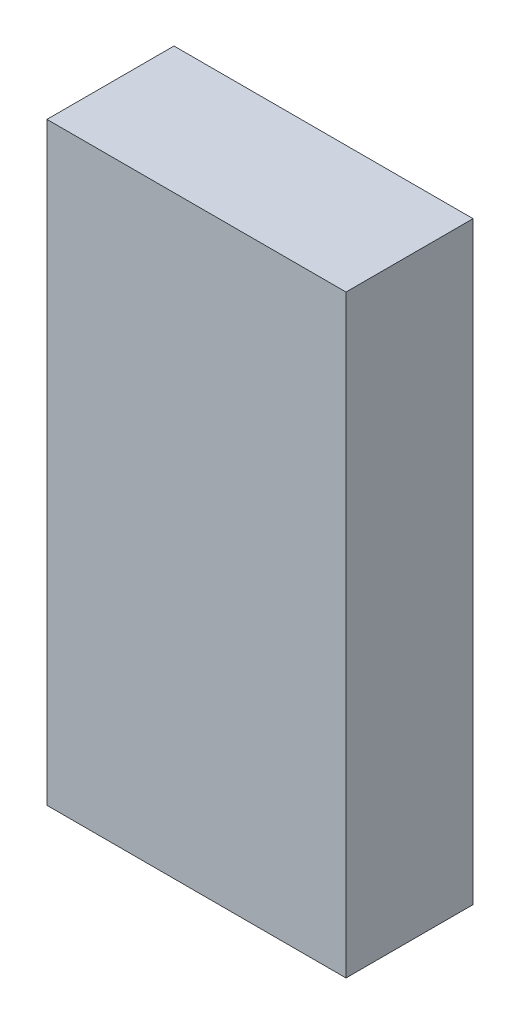
ISO-10303-21;
HEADER;
FILE_DESCRIPTION(('STEP AP214'),'2;1');
FILE_NAME('part.step','',(''),(''),'','','');
FILE_SCHEMA(('AUTOMOTIVE_DESIGN { 1 0 10303 214 1 1 1 1 }'));
ENDSEC;
DATA;
#1=APPLICATION_CONTEXT('core data for automotive mechanical design processes');
#2=APPLICATION_PROTOCOL_DEFINITION('international standard','automotive_design',2000,#1);
#3=PRODUCT_CONTEXT('',#1,'mechanical');
#4=PRODUCT('Part','Part','',(#3));
#5=PRODUCT_RELATED_PRODUCT_CATEGORY('part','',(#4));
#6=PRODUCT_DEFINITION_FORMATION('','',#4);
#7=PRODUCT_DEFINITION_CONTEXT('part definition',#1,'design');
#8=PRODUCT_DEFINITION('design','',#6,#7);
#9=PRODUCT_DEFINITION_SHAPE('','',#8);
#10=(LENGTH_UNIT() NAMED_UNIT(*) SI_UNIT(.MILLI.,.METRE.));
#11=(NAMED_UNIT(*) PLANE_ANGLE_UNIT() SI_UNIT($,.RADIAN.));
#12=(NAMED_UNIT(*) SI_UNIT($,.STERADIAN.) SOLID_ANGLE_UNIT());
#13=UNCERTAINTY_MEASURE_WITH_UNIT(LENGTH_MEASURE(1.E-05),#10,'distance_accuracy_value','');
#14=(GEOMETRIC_REPRESENTATION_CONTEXT(3) GLOBAL_UNCERTAINTY_ASSIGNED_CONTEXT((#13)) GLOBAL_UNIT_ASSIGNED_CONTEXT((#10,
#11,#12)) REPRESENTATION_CONTEXT('',''));
#15=CARTESIAN_POINT('',(0.,0.,0.));
#16=DIRECTION('',(0.,0.,1.));
#17=DIRECTION('',(1.,0.,0.));
#18=AXIS2_PLACEMENT_3D('',#15,#16,#17);
#19=CARTESIAN_POINT('',(12.2555,48.6918,5.207));
#20=DIRECTION('',(-1.,0.,0.));
#21=DIRECTION('',(0.,0.,1.));
#22=AXIS2_PLACEMENT_3D('',#19,#20,#21);
#23=PLANE('',#22);
#24=DIRECTION('',(0.,0.,-1.));
#25=VECTOR('',#24,1.);
#26=CARTESIAN_POINT('',(12.2555,0.,5.207));
#27=LINE('',#26,#25);
#28=CARTESIAN_POINT('',(12.2555,0.,5.207));
#29=VERTEX_POINT('',#28);
#30=CARTESIAN_POINT('',(12.2555,0.,-5.207));
#31=VERTEX_POINT('',#30);
#32=EDGE_CURVE('E113',#29,#31,#27,.T.);
#33=ORIENTED_EDGE('',*,*,#32,.T.);
#34=DIRECTION('',(0.,-1.,0.));
#35=VECTOR('',#34,1.);
#36=CARTESIAN_POINT('',(12.2555,48.6918,-5.207));
#37=LINE('',#36,#35);
#38=CARTESIAN_POINT('',(12.2555,48.6918,-5.207));
#39=VERTEX_POINT('',#38);
#40=EDGE_CURVE('E11',#39,#31,#37,.T.);
#41=ORIENTED_EDGE('',*,*,#40,.F.);
#42=DIRECTION('',(0.,0.,-1.));
#43=VECTOR('',#42,1.);
#44=CARTESIAN_POINT('',(12.2555,48.6918,5.207));
#45=LINE('',#44,#43);
#46=CARTESIAN_POINT('',(12.2555,48.6918,5.207));
#47=VERTEX_POINT('',#46);
#48=EDGE_CURVE('E97',#47,#39,#45,.T.);
#49=ORIENTED_EDGE('',*,*,#48,.F.);
#50=DIRECTION('',(0.,-1.,0.));
#51=VECTOR('',#50,1.);
#52=CARTESIAN_POINT('',(12.2555,48.6918,5.207));
#53=LINE('',#52,#51);
#54=EDGE_CURVE('E109',#47,#29,#53,.T.);
#55=ORIENTED_EDGE('',*,*,#54,.T.);
#56=EDGE_LOOP('',(#33,#41,#49,#55));
#57=FACE_BOUND('',#56,.T.);
#58=ADVANCED_FACE('F45',(#57),#23,.F.);
#59=CARTESIAN_POINT('',(-12.2555,48.6918,-5.207));
#60=DIRECTION('',(0.,0.,1.));
#61=DIRECTION('',(1.,0.,0.));
#62=AXIS2_PLACEMENT_3D('',#59,#60,#61);
#63=PLANE('',#62);
#64=DIRECTION('',(-1.,0.,0.));
#65=VECTOR('',#64,1.);
#66=CARTESIAN_POINT('',(-12.2555,0.,-5.207));
#67=LINE('',#66,#65);
#68=CARTESIAN_POINT('',(-12.2555,0.,-5.207));
#69=VERTEX_POINT('',#68);
#70=EDGE_CURVE('E102',#31,#69,#67,.T.);
#71=ORIENTED_EDGE('',*,*,#70,.T.);
#72=DIRECTION('',(0.,-1.,0.));
#73=VECTOR('',#72,1.);
#74=CARTESIAN_POINT('',(-12.2555,48.6918,-5.207));
#75=LINE('',#74,#73);
#76=CARTESIAN_POINT('',(-12.2555,48.6918,-5.207));
#77=VERTEX_POINT('',#76);
#78=EDGE_CURVE('E54',#77,#69,#75,.T.);
#79=ORIENTED_EDGE('',*,*,#78,.F.);
#80=DIRECTION('',(-1.,0.,0.));
#81=VECTOR('',#80,1.);
#82=CARTESIAN_POINT('',(-12.2555,48.6918,-5.207));
#83=LINE('',#82,#81);
#84=EDGE_CURVE('E92',#39,#77,#83,.T.);
#85=ORIENTED_EDGE('',*,*,#84,.F.);
#86=ORIENTED_EDGE('',*,*,#40,.T.);
#87=EDGE_LOOP('',(#71,#79,#85,#86));
#88=FACE_BOUND('',#87,.T.);
#89=ADVANCED_FACE('F101',(#88),#63,.F.);
#90=CARTESIAN_POINT('',(-12.2555,48.6918,5.207));
#91=DIRECTION('',(1.,0.,0.));
#92=DIRECTION('',(0.,0.,-1.));
#93=AXIS2_PLACEMENT_3D('',#90,#91,#92);
#94=PLANE('',#93);
#95=DIRECTION('',(0.,0.,1.));
#96=VECTOR('',#95,1.);
#97=CARTESIAN_POINT('',(-12.2555,0.,5.207));
#98=LINE('',#97,#96);
#99=CARTESIAN_POINT('',(-12.2555,0.,5.207));
#100=VERTEX_POINT('',#99);
#101=EDGE_CURVE('E79',#69,#100,#98,.T.);
#102=ORIENTED_EDGE('',*,*,#101,.T.);
#103=DIRECTION('',(0.,-1.,0.));
#104=VECTOR('',#103,1.);
#105=CARTESIAN_POINT('',(-12.2555,48.6918,5.207));
#106=LINE('',#105,#104);
#107=CARTESIAN_POINT('',(-12.2555,48.6918,5.207));
#108=VERTEX_POINT('',#107);
#109=EDGE_CURVE('E104',#108,#100,#106,.T.);
#110=ORIENTED_EDGE('',*,*,#109,.F.);
#111=DIRECTION('',(0.,0.,1.));
#112=VECTOR('',#111,1.);
#113=CARTESIAN_POINT('',(-12.2555,48.6918,5.207));
#114=LINE('',#113,#112);
#115=EDGE_CURVE('E95',#77,#108,#114,.T.);
#116=ORIENTED_EDGE('',*,*,#115,.F.);
#117=ORIENTED_EDGE('',*,*,#78,.T.);
#118=EDGE_LOOP('',(#102,#110,#116,#117));
#119=FACE_BOUND('',#118,.T.);
#120=ADVANCED_FACE('F105',(#119),#94,.F.);
#121=CARTESIAN_POINT('',(-12.2555,48.6918,5.207));
#122=DIRECTION('',(0.,0.,-1.));
#123=DIRECTION('',(-1.,0.,0.));
#124=AXIS2_PLACEMENT_3D('',#121,#122,#123);
#125=PLANE('',#124);
#126=DIRECTION('',(1.,0.,0.));
#127=VECTOR('',#126,1.);
#128=CARTESIAN_POINT('',(-12.2555,0.,5.207));
#129=LINE('',#128,#127);
#130=EDGE_CURVE('E85',#100,#29,#129,.T.);
#131=ORIENTED_EDGE('',*,*,#130,.T.);
#132=ORIENTED_EDGE('',*,*,#54,.F.);
#133=DIRECTION('',(1.,0.,0.));
#134=VECTOR('',#133,1.);
#135=CARTESIAN_POINT('',(-12.2555,48.6918,5.207));
#136=LINE('',#135,#134);
#137=EDGE_CURVE('E62',#108,#47,#136,.T.);
#138=ORIENTED_EDGE('',*,*,#137,.F.);
#139=ORIENTED_EDGE('',*,*,#109,.T.);
#140=EDGE_LOOP('',(#131,#132,#138,#139));
#141=FACE_BOUND('',#140,.T.);
#142=ADVANCED_FACE('F126',(#141),#125,.F.);
#143=CARTESIAN_POINT('',(0.,48.6918,0.));
#144=DIRECTION('',(0.,-1.,0.));
#145=DIRECTION('',(0.,0.,-1.));
#146=AXIS2_PLACEMENT_3D('',#143,#144,#145);
#147=PLANE('',#146);
#148=ORIENTED_EDGE('',*,*,#48,.T.);
#149=ORIENTED_EDGE('',*,*,#84,.T.);
#150=ORIENTED_EDGE('',*,*,#115,.T.);
#151=ORIENTED_EDGE('',*,*,#137,.T.);
#152=EDGE_LOOP('',(#148,#149,#150,#151));
#153=FACE_BOUND('',#152,.T.);
#154=ADVANCED_FACE('F93',(#153),#147,.F.);
#155=CARTESIAN_POINT('',(0.,0.,0.));
#156=DIRECTION('',(0.,-1.,0.));
#157=DIRECTION('',(0.,0.,-1.));
#158=AXIS2_PLACEMENT_3D('',#155,#156,#157);
#159=PLANE('',#158);
#160=ORIENTED_EDGE('',*,*,#32,.F.);
#161=ORIENTED_EDGE('',*,*,#130,.F.);
#162=ORIENTED_EDGE('',*,*,#101,.F.);
#163=ORIENTED_EDGE('',*,*,#70,.F.);
#164=EDGE_LOOP('',(#160,#161,#162,#163));
#165=FACE_BOUND('',#164,.T.);
#166=ADVANCED_FACE('F129',(#165),#159,.T.);
#167=CLOSED_SHELL('',(#58,#89,#120,#142,#154,#166));
#168=MANIFOLD_SOLID_BREP('B2',#167);
#169=ADVANCED_BREP_SHAPE_REPRESENTATION('',(#18,#168),#14);
#170=SHAPE_DEFINITION_REPRESENTATION(#9,#169);
ENDSEC;
END-ISO-10303-21;
